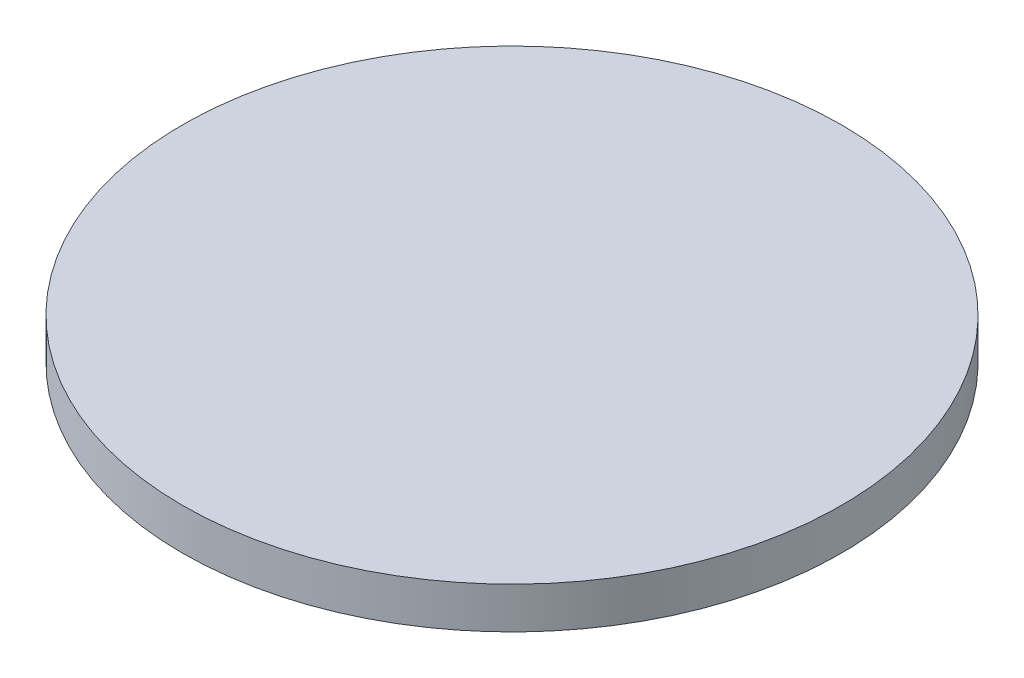
ISO-10303-21;
HEADER;
FILE_DESCRIPTION(('STEP AP214'),'2;1');
FILE_NAME('part.step','',(''),(''),'','','');
FILE_SCHEMA(('AUTOMOTIVE_DESIGN { 1 0 10303 214 1 1 1 1 }'));
ENDSEC;
DATA;
#1=APPLICATION_CONTEXT('core data for automotive mechanical design processes');
#2=APPLICATION_PROTOCOL_DEFINITION('international standard','automotive_design',2000,#1);
#3=PRODUCT_CONTEXT('',#1,'mechanical');
#4=PRODUCT('Part','Part','',(#3));
#5=PRODUCT_RELATED_PRODUCT_CATEGORY('part','',(#4));
#6=PRODUCT_DEFINITION_FORMATION('','',#4);
#7=PRODUCT_DEFINITION_CONTEXT('part definition',#1,'design');
#8=PRODUCT_DEFINITION('design','',#6,#7);
#9=PRODUCT_DEFINITION_SHAPE('','',#8);
#10=(LENGTH_UNIT() NAMED_UNIT(*) SI_UNIT(.MILLI.,.METRE.));
#11=(NAMED_UNIT(*) PLANE_ANGLE_UNIT() SI_UNIT($,.RADIAN.));
#12=(NAMED_UNIT(*) SI_UNIT($,.STERADIAN.) SOLID_ANGLE_UNIT());
#13=UNCERTAINTY_MEASURE_WITH_UNIT(LENGTH_MEASURE(1.E-05),#10,'distance_accuracy_value','');
#14=(GEOMETRIC_REPRESENTATION_CONTEXT(3) GLOBAL_UNCERTAINTY_ASSIGNED_CONTEXT((#13)) GLOBAL_UNIT_ASSIGNED_CONTEXT((#10,
#11,#12)) REPRESENTATION_CONTEXT('',''));
#15=CARTESIAN_POINT('',(0.,0.,0.));
#16=DIRECTION('',(0.,0.,1.));
#17=DIRECTION('',(1.,0.,0.));
#18=AXIS2_PLACEMENT_3D('',#15,#16,#17);
#19=CARTESIAN_POINT('',(0.,5.,0.));
#20=DIRECTION('',(0.,-1.,0.));
#21=DIRECTION('',(0.,0.,-1.));
#22=AXIS2_PLACEMENT_3D('',#19,#20,#21);
#23=CYLINDRICAL_SURFACE('',#22,39.8179700328845);
#24=CARTESIAN_POINT('',(0.,5.,0.));
#25=DIRECTION('',(0.,1.,0.));
#26=DIRECTION('',(0.,0.,1.));
#27=AXIS2_PLACEMENT_3D('',#24,#25,#26);
#28=CIRCLE('',#27,39.8179700328845);
#29=CARTESIAN_POINT('',(0.,5.,39.8179700328845));
#30=VERTEX_POINT('',#29);
#31=EDGE_CURVE('E10',#30,#30,#28,.T.);
#32=ORIENTED_EDGE('',*,*,#31,.F.);
#33=EDGE_LOOP('',(#32));
#34=FACE_BOUND('',#33,.T.);
#35=CARTESIAN_POINT('',(0.,0.,0.));
#36=DIRECTION('',(0.,1.,0.));
#37=DIRECTION('',(0.,0.,1.));
#38=AXIS2_PLACEMENT_3D('',#35,#36,#37);
#39=CIRCLE('',#38,39.8179700328845);
#40=CARTESIAN_POINT('',(0.,0.,39.8179700328845));
#41=VERTEX_POINT('',#40);
#42=EDGE_CURVE('E48',#41,#41,#39,.T.);
#43=ORIENTED_EDGE('',*,*,#42,.T.);
#44=EDGE_LOOP('',(#43));
#45=FACE_BOUND('',#44,.T.);
#46=ADVANCED_FACE('F45',(#34,#45),#23,.T.);
#47=CARTESIAN_POINT('',(0.,5.,0.));
#48=DIRECTION('',(0.,1.,0.));
#49=DIRECTION('',(0.,0.,1.));
#50=AXIS2_PLACEMENT_3D('',#47,#48,#49);
#51=PLANE('',#50);
#52=ORIENTED_EDGE('',*,*,#31,.T.);
#53=EDGE_LOOP('',(#52));
#54=FACE_BOUND('',#53,.T.);
#55=ADVANCED_FACE('F62',(#54),#51,.T.);
#56=CARTESIAN_POINT('',(0.,0.,0.));
#57=DIRECTION('',(0.,1.,0.));
#58=DIRECTION('',(0.,0.,1.));
#59=AXIS2_PLACEMENT_3D('',#56,#57,#58);
#60=PLANE('',#59);
#61=ORIENTED_EDGE('',*,*,#42,.F.);
#62=EDGE_LOOP('',(#61));
#63=FACE_BOUND('',#62,.T.);
#64=ADVANCED_FACE('F60',(#63),#60,.F.);
#65=CLOSED_SHELL('',(#46,#55,#64));
#66=MANIFOLD_SOLID_BREP('B2',#65);
#67=ADVANCED_BREP_SHAPE_REPRESENTATION('',(#18,#66),#14);
#68=SHAPE_DEFINITION_REPRESENTATION(#9,#67);
ENDSEC;
END-ISO-10303-21;
